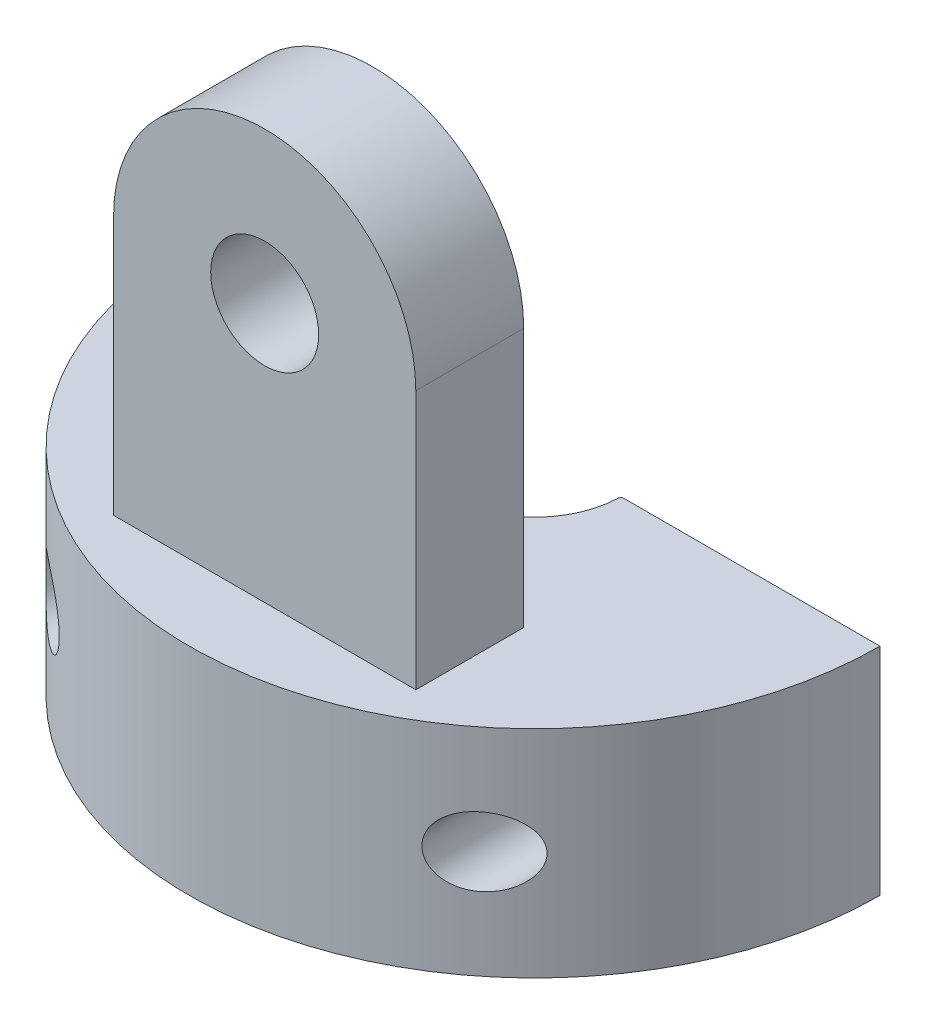
ISO-10303-21;
HEADER;
FILE_DESCRIPTION(('STEP AP214'),'2;1');
FILE_NAME('part.step','',(''),(''),'','','');
FILE_SCHEMA(('AUTOMOTIVE_DESIGN { 1 0 10303 214 1 1 1 1 }'));
ENDSEC;
DATA;
#1=APPLICATION_CONTEXT('core data for automotive mechanical design processes');
#2=APPLICATION_PROTOCOL_DEFINITION('international standard','automotive_design',2000,#1);
#3=PRODUCT_CONTEXT('',#1,'mechanical');
#4=PRODUCT('Part','Part','',(#3));
#5=PRODUCT_RELATED_PRODUCT_CATEGORY('part','',(#4));
#6=PRODUCT_DEFINITION_FORMATION('','',#4);
#7=PRODUCT_DEFINITION_CONTEXT('part definition',#1,'design');
#8=PRODUCT_DEFINITION('design','',#6,#7);
#9=PRODUCT_DEFINITION_SHAPE('','',#8);
#10=(LENGTH_UNIT() NAMED_UNIT(*) SI_UNIT(.MILLI.,.METRE.));
#11=(NAMED_UNIT(*) PLANE_ANGLE_UNIT() SI_UNIT($,.RADIAN.));
#12=(NAMED_UNIT(*) SI_UNIT($,.STERADIAN.) SOLID_ANGLE_UNIT());
#13=UNCERTAINTY_MEASURE_WITH_UNIT(LENGTH_MEASURE(1.E-05),#10,'distance_accuracy_value','');
#14=(GEOMETRIC_REPRESENTATION_CONTEXT(3) GLOBAL_UNCERTAINTY_ASSIGNED_CONTEXT((#13)) GLOBAL_UNIT_ASSIGNED_CONTEXT((#10,
#11,#12)) REPRESENTATION_CONTEXT('',''));
#15=CARTESIAN_POINT('',(0.,0.,0.));
#16=DIRECTION('',(0.,0.,1.));
#17=DIRECTION('',(1.,0.,0.));
#18=AXIS2_PLACEMENT_3D('',#15,#16,#17);
#19=CARTESIAN_POINT('',(3.5,12.,6.25));
#20=DIRECTION('',(0.,0.,1.));
#21=DIRECTION('',(1.,0.,0.));
#22=AXIS2_PLACEMENT_3D('',#19,#20,#21);
#23=PLANE('',#22);
#24=CARTESIAN_POINT('',(0.,8.5,6.25));
#25=DIRECTION('',(0.,0.,1.));
#26=DIRECTION('',(1.,0.,0.));
#27=AXIS2_PLACEMENT_3D('',#24,#25,#26);
#28=CIRCLE('',#27,1.25);
#29=CARTESIAN_POINT('',(1.25,8.5,6.25));
#30=VERTEX_POINT('',#29);
#31=EDGE_CURVE('E131',#30,#30,#28,.T.);
#32=ORIENTED_EDGE('',*,*,#31,.F.);
#33=EDGE_LOOP('',(#32));
#34=FACE_BOUND('',#33,.T.);
#35=DIRECTION('',(0.,-1.,0.));
#36=VECTOR('',#35,1.);
#37=CARTESIAN_POINT('',(3.5,12.,6.25));
#38=LINE('',#37,#36);
#39=CARTESIAN_POINT('',(3.5,8.5,6.25));
#40=VERTEX_POINT('',#39);
#41=CARTESIAN_POINT('',(3.5,2.5,6.25));
#42=VERTEX_POINT('',#41);
#43=EDGE_CURVE('E137',#40,#42,#38,.T.);
#44=ORIENTED_EDGE('',*,*,#43,.F.);
#45=CARTESIAN_POINT('',(0.,8.5,6.25));
#46=DIRECTION('',(0.,0.,1.));
#47=DIRECTION('',(1.,0.,0.));
#48=AXIS2_PLACEMENT_3D('',#45,#46,#47);
#49=CIRCLE('',#48,3.5);
#50=CARTESIAN_POINT('',(-3.5,8.5,6.25));
#51=VERTEX_POINT('',#50);
#52=EDGE_CURVE('E118',#40,#51,#49,.T.);
#53=ORIENTED_EDGE('',*,*,#52,.T.);
#54=DIRECTION('',(0.,-1.,0.));
#55=VECTOR('',#54,1.);
#56=CARTESIAN_POINT('',(-3.5,12.,6.25));
#57=LINE('',#56,#55);
#58=CARTESIAN_POINT('',(-3.5,2.5,6.25));
#59=VERTEX_POINT('',#58);
#60=EDGE_CURVE('E141',#51,#59,#57,.T.);
#61=ORIENTED_EDGE('',*,*,#60,.T.);
#62=DIRECTION('',(-1.,0.,0.));
#63=VECTOR('',#62,1.);
#64=CARTESIAN_POINT('',(3.5,2.5,6.25));
#65=LINE('',#64,#63);
#66=EDGE_CURVE('E284',#42,#59,#65,.T.);
#67=ORIENTED_EDGE('',*,*,#66,.F.);
#68=EDGE_LOOP('',(#44,#53,#61,#67));
#69=FACE_BOUND('',#68,.T.);
#70=ADVANCED_FACE('F35',(#34,#69),#23,.T.);
#71=CARTESIAN_POINT('',(3.5,12.,6.25));
#72=DIRECTION('',(-1.,0.,0.));
#73=DIRECTION('',(0.,0.,1.));
#74=AXIS2_PLACEMENT_3D('',#71,#72,#73);
#75=PLANE('',#74);
#76=DIRECTION('',(0.,0.,-1.));
#77=VECTOR('',#76,1.);
#78=CARTESIAN_POINT('',(3.5,8.5,13.25));
#79=LINE('',#78,#77);
#80=CARTESIAN_POINT('',(3.5,8.5,3.75));
#81=VERTEX_POINT('',#80);
#82=EDGE_CURVE('E112',#40,#81,#79,.T.);
#83=ORIENTED_EDGE('',*,*,#82,.F.);
#84=ORIENTED_EDGE('',*,*,#43,.T.);
#85=DIRECTION('',(0.,0.,-1.));
#86=VECTOR('',#85,1.);
#87=CARTESIAN_POINT('',(3.5,2.5,6.25));
#88=LINE('',#87,#86);
#89=CARTESIAN_POINT('',(3.5,2.5,3.75));
#90=VERTEX_POINT('',#89);
#91=EDGE_CURVE('E136',#42,#90,#88,.T.);
#92=ORIENTED_EDGE('',*,*,#91,.T.);
#93=DIRECTION('',(0.,-1.,0.));
#94=VECTOR('',#93,1.);
#95=CARTESIAN_POINT('',(3.5,12.,3.75));
#96=LINE('',#95,#94);
#97=EDGE_CURVE('E128',#81,#90,#96,.T.);
#98=ORIENTED_EDGE('',*,*,#97,.F.);
#99=EDGE_LOOP('',(#83,#84,#92,#98));
#100=FACE_BOUND('',#99,.T.);
#101=ADVANCED_FACE('F134',(#100),#75,.F.);
#102=CARTESIAN_POINT('',(3.5,12.,3.75));
#103=DIRECTION('',(0.,0.,1.));
#104=DIRECTION('',(1.,0.,0.));
#105=AXIS2_PLACEMENT_3D('',#102,#103,#104);
#106=PLANE('',#105);
#107=CARTESIAN_POINT('',(0.,8.5,3.75));
#108=DIRECTION('',(0.,0.,-1.));
#109=DIRECTION('',(-1.,0.,0.));
#110=AXIS2_PLACEMENT_3D('',#107,#108,#109);
#111=CIRCLE('',#110,1.25);
#112=CARTESIAN_POINT('',(-1.25,8.5,3.75));
#113=VERTEX_POINT('',#112);
#114=EDGE_CURVE('E177',#113,#113,#111,.T.);
#115=ORIENTED_EDGE('',*,*,#114,.F.);
#116=EDGE_LOOP('',(#115));
#117=FACE_BOUND('',#116,.T.);
#118=CARTESIAN_POINT('',(0.,8.5,3.75));
#119=DIRECTION('',(0.,0.,-1.));
#120=DIRECTION('',(-1.,0.,0.));
#121=AXIS2_PLACEMENT_3D('',#118,#119,#120);
#122=CIRCLE('',#121,3.5);
#123=CARTESIAN_POINT('',(-3.5,8.5,3.75));
#124=VERTEX_POINT('',#123);
#125=EDGE_CURVE('E116',#124,#81,#122,.T.);
#126=ORIENTED_EDGE('',*,*,#125,.T.);
#127=ORIENTED_EDGE('',*,*,#97,.T.);
#128=DIRECTION('',(-1.,0.,0.));
#129=VECTOR('',#128,1.);
#130=CARTESIAN_POINT('',(3.5,2.5,3.75));
#131=LINE('',#130,#129);
#132=CARTESIAN_POINT('',(-3.5,2.5,3.75));
#133=VERTEX_POINT('',#132);
#134=EDGE_CURVE('E290',#90,#133,#131,.T.);
#135=ORIENTED_EDGE('',*,*,#134,.T.);
#136=DIRECTION('',(0.,-1.,0.));
#137=VECTOR('',#136,1.);
#138=CARTESIAN_POINT('',(-3.5,12.,3.75));
#139=LINE('',#138,#137);
#140=EDGE_CURVE('E130',#124,#133,#139,.T.);
#141=ORIENTED_EDGE('',*,*,#140,.F.);
#142=EDGE_LOOP('',(#126,#127,#135,#141));
#143=FACE_BOUND('',#142,.T.);
#144=ADVANCED_FACE('F126',(#117,#143),#106,.F.);
#145=CARTESIAN_POINT('',(0.,2.5,0.));
#146=DIRECTION('',(0.,-1.,0.));
#147=DIRECTION('',(0.,0.,-1.));
#148=AXIS2_PLACEMENT_3D('',#145,#146,#147);
#149=CYLINDRICAL_SURFACE('',#148,2.);
#150=CARTESIAN_POINT('',(0.,-2.5,0.));
#151=DIRECTION('',(0.,-1.,0.));
#152=DIRECTION('',(0.,0.,-1.));
#153=AXIS2_PLACEMENT_3D('',#150,#151,#152);
#154=CIRCLE('',#153,2.);
#155=CARTESIAN_POINT('',(1.99885612227799,-2.5,0.067632850241546));
#156=VERTEX_POINT('',#155);
#157=CARTESIAN_POINT('',(-1.99885612227799,-2.5,0.067632850241546));
#158=VERTEX_POINT('',#157);
#159=EDGE_CURVE('E139',#156,#158,#154,.T.);
#160=ORIENTED_EDGE('',*,*,#159,.T.);
#161=DIRECTION('',(0.,-1.,0.));
#162=VECTOR('',#161,1.);
#163=CARTESIAN_POINT('',(-1.99885612227799,2.5,0.067632850241546));
#164=LINE('',#163,#162);
#165=CARTESIAN_POINT('',(-1.99885612227799,2.5,0.067632850241546));
#166=VERTEX_POINT('',#165);
#167=EDGE_CURVE('E56',#158,#166,#164,.F.);
#168=ORIENTED_EDGE('',*,*,#167,.T.);
#169=CARTESIAN_POINT('',(0.,2.5,0.));
#170=DIRECTION('',(0.,-1.,0.));
#171=DIRECTION('',(0.,0.,-1.));
#172=AXIS2_PLACEMENT_3D('',#169,#170,#171);
#173=CIRCLE('',#172,2.);
#174=CARTESIAN_POINT('',(1.99885612227799,2.5,0.067632850241546));
#175=VERTEX_POINT('',#174);
#176=EDGE_CURVE('E146',#175,#166,#173,.T.);
#177=ORIENTED_EDGE('',*,*,#176,.F.);
#178=DIRECTION('',(0.,-1.,0.));
#179=VECTOR('',#178,1.);
#180=CARTESIAN_POINT('',(1.99885612227799,2.5,0.067632850241546));
#181=LINE('',#180,#179);
#182=EDGE_CURVE('E241',#175,#156,#181,.T.);
#183=ORIENTED_EDGE('',*,*,#182,.T.);
#184=EDGE_LOOP('',(#160,#168,#177,#183));
#185=FACE_BOUND('',#184,.T.);
#186=ADVANCED_FACE('F206',(#185),#149,.F.);
#187=CARTESIAN_POINT('',(-2.,2.5,0.));
#188=DIRECTION('',(0.,0.,1.));
#189=DIRECTION('',(1.,0.,0.));
#190=AXIS2_PLACEMENT_3D('',#187,#188,#189);
#191=PLANE('',#190);
#192=CARTESIAN_POINT('',(-5.,0.,0.));
#193=DIRECTION('',(0.,0.,-1.));
#194=DIRECTION('',(-1.,0.,0.));
#195=AXIS2_PLACEMENT_3D('',#192,#193,#194);
#196=CIRCLE('',#195,0.799999999999999);
#197=CARTESIAN_POINT('',(-5.8,0.,0.));
#198=VERTEX_POINT('',#197);
#199=EDGE_CURVE('E178',#198,#198,#196,.T.);
#200=ORIENTED_EDGE('',*,*,#199,.F.);
#201=EDGE_LOOP('',(#200));
#202=FACE_BOUND('',#201,.T.);
#203=DIRECTION('',(-1.,0.,0.));
#204=VECTOR('',#203,1.);
#205=CARTESIAN_POINT('',(-2.,2.5,0.));
#206=LINE('',#205,#204);
#207=CARTESIAN_POINT('',(-2.06881608655772,2.5,0.));
#208=VERTEX_POINT('',#207);
#209=CARTESIAN_POINT('',(-8.,2.5,0.));
#210=VERTEX_POINT('',#209);
#211=EDGE_CURVE('E148',#208,#210,#206,.T.);
#212=ORIENTED_EDGE('',*,*,#211,.F.);
#213=DIRECTION('',(0.,-1.,0.));
#214=VECTOR('',#213,1.);
#215=CARTESIAN_POINT('',(-2.06881608655772,2.5,0.));
#216=LINE('',#215,#214);
#217=CARTESIAN_POINT('',(-2.06881608655772,-2.5,0.));
#218=VERTEX_POINT('',#217);
#219=EDGE_CURVE('E169',#208,#218,#216,.T.);
#220=ORIENTED_EDGE('',*,*,#219,.T.);
#221=DIRECTION('',(-1.,0.,0.));
#222=VECTOR('',#221,1.);
#223=CARTESIAN_POINT('',(-2.,-2.5,0.));
#224=LINE('',#223,#222);
#225=CARTESIAN_POINT('',(-8.,-2.5,0.));
#226=VERTEX_POINT('',#225);
#227=EDGE_CURVE('E158',#218,#226,#224,.T.);
#228=ORIENTED_EDGE('',*,*,#227,.T.);
#229=DIRECTION('',(0.,-1.,0.));
#230=VECTOR('',#229,1.);
#231=CARTESIAN_POINT('',(-8.,2.5,0.));
#232=LINE('',#231,#230);
#233=EDGE_CURVE('E166',#210,#226,#232,.T.);
#234=ORIENTED_EDGE('',*,*,#233,.F.);
#235=EDGE_LOOP('',(#212,#220,#228,#234));
#236=FACE_BOUND('',#235,.T.);
#237=ADVANCED_FACE('F228',(#202,#236),#191,.F.);
#238=CARTESIAN_POINT('',(0.,2.5,0.));
#239=DIRECTION('',(0.,-1.,0.));
#240=DIRECTION('',(0.,0.,-1.));
#241=AXIS2_PLACEMENT_3D('',#238,#239,#240);
#242=CYLINDRICAL_SURFACE('',#241,8.);
#243=CARTESIAN_POINT('',(4.2,0.,6.80881781221968));
#244=CARTESIAN_POINT('',(4.19999815658813,0.0398519375539786,6.80881874752186));
#245=CARTESIAN_POINT('',(4.20299070168571,0.0796936510163014,6.8069756681062));
#246=CARTESIAN_POINT('',(4.21478727328823,0.158158117485728,6.7996776298651));
#247=CARTESIAN_POINT('',(4.22359042597688,0.196781052861335,6.79422321412269));
#248=CARTESIAN_POINT('',(4.24651019872021,0.271628923056093,6.77992115743238));
#249=CARTESIAN_POINT('',(4.26061355340452,0.307859581301269,6.77108198682769));
#250=CARTESIAN_POINT('',(4.29345544547942,0.3771831476823,6.75030490819633));
#251=CARTESIAN_POINT('',(4.31219496341803,0.410275389992716,6.73836634462201));
#252=CARTESIAN_POINT('',(4.35450543851684,0.474210553880899,6.71110596120041));
#253=CARTESIAN_POINT('',(4.37826397170844,0.504871324546449,6.69565010494241));
#254=CARTESIAN_POINT('',(4.42907773478792,0.561696158657103,6.6621465721134));
#255=CARTESIAN_POINT('',(4.4561341027191,0.587858662253455,6.64409800044151));
#256=CARTESIAN_POINT('',(4.51656316341039,0.638793164596562,6.60319322188424));
#257=CARTESIAN_POINT('',(4.55029323854408,0.662882584040535,6.58001713954043));
#258=CARTESIAN_POINT('',(4.61980156941114,0.705056513787978,6.53140388253074));
#259=CARTESIAN_POINT('',(4.65558105668972,0.723137368049157,6.50596534311183));
#260=CARTESIAN_POINT('',(4.73471532012716,0.756156332538808,6.44866297984592));
#261=CARTESIAN_POINT('',(4.77829069655179,0.769973053391657,6.4164584851251));
#262=CARTESIAN_POINT('',(4.86585376369878,0.789952213298812,6.3503139197531));
#263=CARTESIAN_POINT('',(4.90984164405192,0.796110938674948,6.31637301534489));
#264=CARTESIAN_POINT('',(5.00544335465519,0.801665326593537,6.24098445427765));
#265=CARTESIAN_POINT('',(5.05696402421883,0.79960063425965,6.19930878626382));
#266=CARTESIAN_POINT('',(5.15824057209058,0.785860494832465,6.11530022446198));
#267=CARTESIAN_POINT('',(5.20799379872201,0.774171194742353,6.0729664696926));
#268=CARTESIAN_POINT('',(5.31091648898486,0.739359762024547,5.98325982899339));
#269=CARTESIAN_POINT('',(5.36370429897909,0.714962334998839,5.93593788085564));
#270=CARTESIAN_POINT('',(5.46417110489983,0.654206144462932,5.84358309029608));
#271=CARTESIAN_POINT('',(5.5118579576136,0.617866137754804,5.79854678531797));
#272=CARTESIAN_POINT('',(5.58423578633552,0.547921068401668,5.72868892716459));
#273=CARTESIAN_POINT('',(5.61105598994912,0.517976708158641,5.70239341170217));
#274=CARTESIAN_POINT('',(5.66083914587371,0.452735802526572,5.65297448542324));
#275=CARTESIAN_POINT('',(5.68380894754742,0.417448978229508,5.62984545557399));
#276=CARTESIAN_POINT('',(5.72013138845229,0.350043436918286,5.59290752424896));
#277=CARTESIAN_POINT('',(5.73448609387071,0.318978845122978,5.57817088409482));
#278=CARTESIAN_POINT('',(5.75943501785463,0.253908330320489,5.55240760398823));
#279=CARTESIAN_POINT('',(5.77003167378517,0.219904331596927,5.54137855963637));
#280=CARTESIAN_POINT('',(5.78679180136054,0.14928497444153,5.52387476991184));
#281=CARTESIAN_POINT('',(5.79291113445185,0.112647426546002,5.51744538248681));
#282=CARTESIAN_POINT('',(5.79994863533432,0.0383418519414037,5.51004763957584));
#283=CARTESIAN_POINT('',(5.80087216500529,0.000674927875699032,5.50907365431824));
#284=CARTESIAN_POINT('',(5.79769888747086,-0.0685037570937168,5.51241222283676));
#285=CARTESIAN_POINT('',(5.79433369049144,-0.100092002778029,5.51595440629535));
#286=CARTESIAN_POINT('',(5.78404934819513,-0.162028168005945,5.52673757576545));
#287=CARTESIAN_POINT('',(5.77712867276166,-0.192375547461649,5.53398015425168));
#288=CARTESIAN_POINT('',(5.75804851005671,-0.258499860525437,5.55383728681834));
#289=CARTESIAN_POINT('',(5.74501529008499,-0.293756003579797,5.56733879758455));
#290=CARTESIAN_POINT('',(5.71499740640622,-0.360738415603172,5.59814860781558));
#291=CARTESIAN_POINT('',(5.69800607021407,-0.392458588717965,5.61546333277194));
#292=CARTESIAN_POINT('',(5.65410649965383,-0.463085939740555,5.65971416715389));
#293=CARTESIAN_POINT('',(5.62584236015895,-0.500389864031218,5.68785521608543));
#294=CARTESIAN_POINT('',(5.56499040932441,-0.568215459687125,5.74740875017831));
#295=CARTESIAN_POINT('',(5.53239506335732,-0.598725058249408,5.7788269152972));
#296=CARTESIAN_POINT('',(5.45318497279639,-0.66175864313667,5.85376698178726));
#297=CARTESIAN_POINT('',(5.4053727770045,-0.691931406884803,5.89800256137496));
#298=CARTESIAN_POINT('',(5.3056469713107,-0.741404186505946,5.98787376217017));
#299=CARTESIAN_POINT('',(5.25373036093444,-0.760696162747686,6.03351039240693));
#300=CARTESIAN_POINT('',(5.14647198093169,-0.788445017474554,6.12526387804842));
#301=CARTESIAN_POINT('',(5.09109960104531,-0.796784213023055,6.17138066720966));
#302=CARTESIAN_POINT('',(4.97880399747824,-0.801688024707797,6.26232519771531));
#303=CARTESIAN_POINT('',(4.92188202226315,-0.79826185671176,6.30715392026407));
#304=CARTESIAN_POINT('',(4.81720292939666,-0.780347154439991,6.38734680033512));
#305=CARTESIAN_POINT('',(4.7694201485329,-0.767693908396838,6.42308651699252));
#306=CARTESIAN_POINT('',(4.67538048419636,-0.732890536898496,6.49185603190666));
#307=CARTESIAN_POINT('',(4.62912182186304,-0.710751937971945,6.52488906145815));
#308=CARTESIAN_POINT('',(4.54785540560439,-0.661369787494114,6.58171908485209));
#309=CARTESIAN_POINT('',(4.5123031664144,-0.635717534198905,6.60611707183476));
#310=CARTESIAN_POINT('',(4.44478131880778,-0.577677385096719,6.65173484790557));
#311=CARTESIAN_POINT('',(4.41281099841518,-0.545290831530873,6.6729552688799));
#312=CARTESIAN_POINT('',(4.35374537905656,-0.473834746600487,6.71164369469396));
#313=CARTESIAN_POINT('',(4.32669055111269,-0.434714483302282,6.72908075912679));
#314=CARTESIAN_POINT('',(4.27945072467692,-0.350879475964772,6.75922277977894));
#315=CARTESIAN_POINT('',(4.25925973322227,-0.306169659185623,6.77193186501779));
#316=CARTESIAN_POINT('',(4.22914142917108,-0.218333184609024,6.79077620742901));
#317=CARTESIAN_POINT('',(4.21827455362461,-0.175658131299035,6.797516449311));
#318=CARTESIAN_POINT('',(4.20370738027974,-0.0886503795811212,6.80653516508109));
#319=CARTESIAN_POINT('',(4.2000020500365,-0.0443188675187276,6.8088167720812));
#320=CARTESIAN_POINT('',(4.2,0.,6.80881781221968));
#321=B_SPLINE_CURVE_WITH_KNOTS('',3,(#243,#244,#245,#246,#247,#248,#249,#250,#251,#252,#253,
#254,#255,#256,#257,#258,#259,#260,#261,#262,#263,#264,#265,#266,#267,#268,#269,#270,#271,#272,
#273,#274,#275,#276,#277,#278,#279,#280,#281,#282,#283,#284,#285,#286,#287,#288,#289,#290,#291,
#292,#293,#294,#295,#296,#297,#298,#299,#300,#301,#302,#303,#304,#305,#306,#307,#308,#309,#310,
#311,#312,#313,#314,#315,#316,#317,#318,#319,#320),.UNSPECIFIED.,.T.,.F.,(4,2,2,2,2,2,2,2,2,2,2,
2,2,2,2,2,2,2,2,2,2,2,2,2,2,2,2,2,2,2,2,2,2,2,2,2,2,2,4),(0.,0.119386956410995,
0.238755963148914,0.357828180984911,0.476925604143475,0.601694361897775,0.726506298409561,
0.868432573671535,1.0104450496153,1.17757391630796,1.34478379911935,1.54289802657,
1.74129790548188,1.96517315359274,2.18869845435768,2.33237150944051,2.47578621250764,
2.58715295307343,2.69844733164416,2.81082461541598,2.92308590862406,3.01852364895732,
3.11400249581101,3.23316837705336,3.35253661754904,3.51547867809495,3.67870799946382,
3.89295859714682,4.10736729430324,4.32406136967572,4.54058574623285,4.72286533673009,
4.90492404791,5.05484084450981,5.20472778916783,5.35579781222864,5.50673559198264,
5.63959780827547,5.77236662779588),.UNSPECIFIED.);
#322=CARTESIAN_POINT('',(4.2,0.,6.80881781221968));
#323=VERTEX_POINT('',#322);
#324=EDGE_CURVE('E179',#323,#323,#321,.T.);
#325=ORIENTED_EDGE('',*,*,#324,.T.);
#326=EDGE_LOOP('',(#325));
#327=FACE_BOUND('',#326,.T.);
#328=CARTESIAN_POINT('',(-5.8,0.,5.50999092558236));
#329=CARTESIAN_POINT('',(-5.79999973358509,0.0355835805720054,5.50999124826604));
#330=CARTESIAN_POINT('',(-5.79760570697369,0.0711688542684127,5.5125145186994));
#331=CARTESIAN_POINT('',(-5.78825657518645,0.141059388361412,5.52233007609707));
#332=CARTESIAN_POINT('',(-5.78129776035944,0.175363583683178,5.52962624182094));
#333=CARTESIAN_POINT('',(-5.76345778785487,0.241446130887767,5.54821738352307));
#334=CARTESIAN_POINT('',(-5.75260786076298,0.273242202337872,5.55948050762745));
#335=CARTESIAN_POINT('',(-5.72763551496213,0.33411234882179,5.58520486413386));
#336=CARTESIAN_POINT('',(-5.71351139285339,0.363184995901577,5.59966776103823));
#337=CARTESIAN_POINT('',(-5.67540560747492,0.43124919694663,5.63833332650835));
#338=CARTESIAN_POINT('',(-5.64989105464832,0.468583150794455,5.66394128377098));
#339=CARTESIAN_POINT('',(-5.59457160287021,0.537057304568443,5.71859180840594));
#340=CARTESIAN_POINT('',(-5.56475655089598,0.568182419616093,5.74764247384825));
#341=CARTESIAN_POINT('',(-5.49118595937438,0.633977987668749,5.81809764546845));
#342=CARTESIAN_POINT('',(-5.44612846531558,0.666280398729729,5.86035450441284));
#343=CARTESIAN_POINT('',(-5.35177965424885,0.720565891945562,5.94664258446718));
#344=CARTESIAN_POINT('',(-5.30248626832814,0.742543897130304,5.99067466700208));
#345=CARTESIAN_POINT('',(-5.20009818086177,0.77647203497336,6.07977357327865));
#346=CARTESIAN_POINT('',(-5.14695875880767,0.788272298288977,6.12484614654851));
#347=CARTESIAN_POINT('',(-5.03869194465854,0.800920520662119,6.21421863764797));
#348=CARTESIAN_POINT('',(-4.98356348147957,0.801762487755128,6.25851811953458));
#349=CARTESIAN_POINT('',(-4.86938758415617,0.79146951180582,6.34780460741192));
#350=CARTESIAN_POINT('',(-4.8103056951263,0.779603136717774,6.39266960759626));
#351=CARTESIAN_POINT('',(-4.69396300000007,0.741662965507482,6.47857262918769));
#352=CARTESIAN_POINT('',(-4.63669815150724,0.715623447925527,6.51961960537207));
#353=CARTESIAN_POINT('',(-4.54564119505754,0.65983541586275,6.58324709631966));
#354=CARTESIAN_POINT('',(-4.51039918612075,0.634233078544581,6.6074153083986));
#355=CARTESIAN_POINT('',(-4.44347673786339,0.576396684069572,6.65260376952235));
#356=CARTESIAN_POINT('',(-4.41179437907718,0.544166227782096,6.67362571717406));
#357=CARTESIAN_POINT('',(-4.35324748055249,0.473123559868047,6.71196509357476));
#358=CARTESIAN_POINT('',(-4.32642297889707,0.434261363858143,6.72925194463207));
#359=CARTESIAN_POINT('',(-4.27954455421549,0.351024248730319,6.7591624485206));
#360=CARTESIAN_POINT('',(-4.25948488531075,0.306654052022607,6.77179005965528));
#361=CARTESIAN_POINT('',(-4.22973812824844,0.220219630065491,6.79040366263643));
#362=CARTESIAN_POINT('',(-4.21901555332227,0.178654261816224,6.79705664081389));
#363=CARTESIAN_POINT('',(-4.20436972317929,0.0939003552319894,6.80612609329367));
#364=CARTESIAN_POINT('',(-4.20044167440536,0.0507129832212249,6.80854555436807));
#365=CARTESIAN_POINT('',(-4.19966837505092,-0.0314891560182067,6.80902220456184));
#366=CARTESIAN_POINT('',(-4.20216594801705,-0.0704975310595007,6.80748414466458));
#367=CARTESIAN_POINT('',(-4.21274668225058,-0.147442897931287,6.80094138630309));
#368=CARTESIAN_POINT('',(-4.22082893718243,-0.185380062568346,6.79593725034649));
#369=CARTESIAN_POINT('',(-4.24207496112872,-0.258844721712143,6.782695142223));
#370=CARTESIAN_POINT('',(-4.2551960372975,-0.294389589163474,6.7744843298707));
#371=CARTESIAN_POINT('',(-4.28591559772556,-0.362607168053462,6.75509112688314));
#372=CARTESIAN_POINT('',(-4.30351500938852,-0.395279282695266,6.74390812072473));
#373=CARTESIAN_POINT('',(-4.34383691341752,-0.459325705342622,6.71801250884323));
#374=CARTESIAN_POINT('',(-4.36683114066248,-0.490450490644214,6.70310810315783));
#375=CARTESIAN_POINT('',(-4.41621696428757,-0.548312276697212,6.67067468208536));
#376=CARTESIAN_POINT('',(-4.44260995776471,-0.575047462720699,6.65314458689614));
#377=CARTESIAN_POINT('',(-4.50157500164994,-0.627149711006334,6.61341388755191));
#378=CARTESIAN_POINT('',(-4.53450323432731,-0.651874890232797,6.59090224869427));
#379=CARTESIAN_POINT('',(-4.60251798276003,-0.695443788911803,6.5435883498285));
#380=CARTESIAN_POINT('',(-4.63760572379955,-0.714284131844135,6.51878478532728));
#381=CARTESIAN_POINT('',(-4.71527487483957,-0.749028199820446,6.4628823516191));
#382=CARTESIAN_POINT('',(-4.75809499933907,-0.763844791121631,6.43144047512458));
#383=CARTESIAN_POINT('',(-4.84429726466845,-0.785964258801264,6.36676497784262));
#384=CARTESIAN_POINT('',(-4.88767968025762,-0.79326330995545,6.3335304539268));
#385=CARTESIAN_POINT('',(-4.98217108191166,-0.801454938606386,6.25956874391525));
#386=CARTESIAN_POINT('',(-5.03321605345837,-0.800903070299313,6.21859787713727));
#387=CARTESIAN_POINT('',(-5.13374057013211,-0.790362305047729,6.13587471551614));
#388=CARTESIAN_POINT('',(-5.18321797694845,-0.780361046521654,6.09412146731082));
#389=CARTESIAN_POINT('',(-5.28619130638612,-0.749247706590643,6.00511582618944));
#390=CARTESIAN_POINT('',(-5.33931391566532,-0.726805374427412,5.95789073542791));
#391=CARTESIAN_POINT('',(-5.44077652493994,-0.670140905247464,5.86537658525044));
#392=CARTESIAN_POINT('',(-5.48912197235412,-0.635932389554335,5.82008535492431));
#393=CARTESIAN_POINT('',(-5.56426933825932,-0.568543713060423,5.74810137094313));
#394=CARTESIAN_POINT('',(-5.59292812806937,-0.538723780085801,5.72018989326539));
#395=CARTESIAN_POINT('',(-5.64631458116874,-0.473342188039791,5.6674974646057));
#396=CARTESIAN_POINT('',(-5.67104918358619,-0.437790893401187,5.6427110039738));
#397=CARTESIAN_POINT('',(-5.71011148341159,-0.369986821652554,5.60314306834854));
#398=CARTESIAN_POINT('',(-5.72551780214544,-0.338933418243957,5.5873806423862));
#399=CARTESIAN_POINT('',(-5.7525606760845,-0.273670874558833,5.55953437688915));
#400=CARTESIAN_POINT('',(-5.76420097678789,-0.239464913448487,5.54744688317178));
#401=CARTESIAN_POINT('',(-5.78212800979315,-0.17148054598356,5.52875678703121));
#402=CARTESIAN_POINT('',(-5.78877968299074,-0.137903504549602,5.52178141154354));
#403=CARTESIAN_POINT('',(-5.79771414827513,-0.0695508936137936,5.51240005932564));
#404=CARTESIAN_POINT('',(-5.80000026037045,-0.0347762553910272,5.50999061021978));
#405=CARTESIAN_POINT('',(-5.8,0.,5.50999092558236));
#406=B_SPLINE_CURVE_WITH_KNOTS('',3,(#328,#329,#330,#331,#332,#333,#334,#335,#336,#337,#338,
#339,#340,#341,#342,#343,#344,#345,#346,#347,#348,#349,#350,#351,#352,#353,#354,#355,#356,#357,
#358,#359,#360,#361,#362,#363,#364,#365,#366,#367,#368,#369,#370,#371,#372,#373,#374,#375,#376,
#377,#378,#379,#380,#381,#382,#383,#384,#385,#386,#387,#388,#389,#390,#391,#392,#393,#394,#395,
#396,#397,#398,#399,#400,#401,#402,#403,#404,#405),.UNSPECIFIED.,.T.,.F.,(4,2,2,2,2,2,2,2,2,2,2,
2,2,2,2,2,2,2,2,2,2,2,2,2,2,2,2,2,2,2,2,2,2,2,2,2,2,2,4),(0.,0.106594223265779,0.2132751795996,
0.319118389438811,0.425016788274055,0.580056688604109,0.735468802088834,0.943503458805495,
1.15164030861527,1.36279210440237,1.57405935252996,1.7981738086664,2.02174862447207,
2.17062288767615,2.31941648436478,2.46938555093108,2.61922691482219,2.7488162251249,
2.87831407246221,2.99510498128706,3.11187694061724,3.2276805996096,3.34350825954311,
3.46741586423834,3.59137456596085,3.73162886646125,3.87196349294204,4.03680127360103,
4.20172288892017,4.39732577758954,4.59318490648068,4.81577809095763,5.03811444914369,
5.18734570714471,5.33631006581448,5.45014360911507,5.56386358858629,5.66811870504593,
5.77229450388095),.UNSPECIFIED.);
#407=CARTESIAN_POINT('',(-5.8,0.,5.50999092558236));
#408=VERTEX_POINT('',#407);
#409=EDGE_CURVE('E170',#408,#408,#406,.T.);
#410=ORIENTED_EDGE('',*,*,#409,.T.);
#411=EDGE_LOOP('',(#410));
#412=FACE_BOUND('',#411,.T.);
#413=CARTESIAN_POINT('',(0.,-2.5,0.));
#414=DIRECTION('',(0.,1.,0.));
#415=DIRECTION('',(0.,0.,1.));
#416=AXIS2_PLACEMENT_3D('',#413,#414,#415);
#417=CIRCLE('',#416,8.);
#418=CARTESIAN_POINT('',(8.,-2.5,0.));
#419=VERTEX_POINT('',#418);
#420=EDGE_CURVE('E160',#226,#419,#417,.T.);
#421=ORIENTED_EDGE('',*,*,#420,.T.);
#422=DIRECTION('',(0.,-1.,0.));
#423=VECTOR('',#422,1.);
#424=CARTESIAN_POINT('',(8.,2.5,0.));
#425=LINE('',#424,#423);
#426=CARTESIAN_POINT('',(8.,2.5,0.));
#427=VERTEX_POINT('',#426);
#428=EDGE_CURVE('E156',#427,#419,#425,.T.);
#429=ORIENTED_EDGE('',*,*,#428,.F.);
#430=CARTESIAN_POINT('',(0.,2.5,0.));
#431=DIRECTION('',(0.,1.,0.));
#432=DIRECTION('',(0.,0.,1.));
#433=AXIS2_PLACEMENT_3D('',#430,#431,#432);
#434=CIRCLE('',#433,8.);
#435=EDGE_CURVE('E151',#210,#427,#434,.T.);
#436=ORIENTED_EDGE('',*,*,#435,.F.);
#437=ORIENTED_EDGE('',*,*,#233,.T.);
#438=EDGE_LOOP('',(#421,#429,#436,#437));
#439=FACE_BOUND('',#438,.T.);
#440=ADVANCED_FACE('F184',(#327,#412,#439),#242,.T.);
#441=CARTESIAN_POINT('',(2.,2.5,0.));
#442=DIRECTION('',(0.,0.,-1.));
#443=DIRECTION('',(-1.,0.,0.));
#444=AXIS2_PLACEMENT_3D('',#441,#442,#443);
#445=PLANE('',#444);
#446=CARTESIAN_POINT('',(5.,0.,0.));
#447=DIRECTION('',(0.,0.,-1.));
#448=DIRECTION('',(-1.,0.,0.));
#449=AXIS2_PLACEMENT_3D('',#446,#447,#448);
#450=CIRCLE('',#449,0.799999999999999);
#451=CARTESIAN_POINT('',(4.2,0.,0.));
#452=VERTEX_POINT('',#451);
#453=EDGE_CURVE('E232',#452,#452,#450,.T.);
#454=ORIENTED_EDGE('',*,*,#453,.F.);
#455=EDGE_LOOP('',(#454));
#456=FACE_BOUND('',#455,.T.);
#457=DIRECTION('',(1.,0.,0.));
#458=VECTOR('',#457,1.);
#459=CARTESIAN_POINT('',(2.,-2.5,0.));
#460=LINE('',#459,#458);
#461=CARTESIAN_POINT('',(2.06881608655772,-2.5,0.));
#462=VERTEX_POINT('',#461);
#463=EDGE_CURVE('E149',#462,#419,#460,.T.);
#464=ORIENTED_EDGE('',*,*,#463,.F.);
#465=DIRECTION('',(0.,1.,0.));
#466=VECTOR('',#465,1.);
#467=CARTESIAN_POINT('',(2.06881608655772,2.5,0.));
#468=LINE('',#467,#466);
#469=CARTESIAN_POINT('',(2.06881608655772,2.5,0.));
#470=VERTEX_POINT('',#469);
#471=EDGE_CURVE('E11',#462,#470,#468,.T.);
#472=ORIENTED_EDGE('',*,*,#471,.T.);
#473=DIRECTION('',(1.,0.,0.));
#474=VECTOR('',#473,1.);
#475=CARTESIAN_POINT('',(2.,2.5,0.));
#476=LINE('',#475,#474);
#477=EDGE_CURVE('E154',#470,#427,#476,.T.);
#478=ORIENTED_EDGE('',*,*,#477,.T.);
#479=ORIENTED_EDGE('',*,*,#428,.T.);
#480=EDGE_LOOP('',(#464,#472,#478,#479));
#481=FACE_BOUND('',#480,.T.);
#482=ADVANCED_FACE('F218',(#456,#481),#445,.T.);
#483=CARTESIAN_POINT('',(0.,2.5,0.));
#484=DIRECTION('',(0.,-1.,0.));
#485=DIRECTION('',(0.,0.,-1.));
#486=AXIS2_PLACEMENT_3D('',#483,#484,#485);
#487=PLANE('',#486);
#488=ORIENTED_EDGE('',*,*,#91,.F.);
#489=ORIENTED_EDGE('',*,*,#66,.T.);
#490=DIRECTION('',(0.,0.,1.));
#491=VECTOR('',#490,1.);
#492=CARTESIAN_POINT('',(-3.5,2.5,3.75));
#493=LINE('',#492,#491);
#494=EDGE_CURVE('E287',#133,#59,#493,.T.);
#495=ORIENTED_EDGE('',*,*,#494,.F.);
#496=ORIENTED_EDGE('',*,*,#134,.F.);
#497=EDGE_LOOP('',(#488,#489,#495,#496));
#498=FACE_BOUND('',#497,.T.);
#499=ORIENTED_EDGE('',*,*,#176,.T.);
#500=CARTESIAN_POINT('',(-2.06881608655772,2.5,0.0700000000000001));
#501=DIRECTION('',(0.,-1.,0.));
#502=DIRECTION('',(0.,0.,-1.));
#503=AXIS2_PLACEMENT_3D('',#500,#501,#502);
#504=CIRCLE('',#503,0.07);
#505=EDGE_CURVE('E43',#166,#208,#504,.F.);
#506=ORIENTED_EDGE('',*,*,#505,.T.);
#507=ORIENTED_EDGE('',*,*,#211,.T.);
#508=ORIENTED_EDGE('',*,*,#435,.T.);
#509=ORIENTED_EDGE('',*,*,#477,.F.);
#510=CARTESIAN_POINT('',(2.06881608655772,2.5,0.0700000000000001));
#511=DIRECTION('',(0.,-1.,0.));
#512=DIRECTION('',(0.,0.,-1.));
#513=AXIS2_PLACEMENT_3D('',#510,#511,#512);
#514=CIRCLE('',#513,0.07);
#515=EDGE_CURVE('E240',#470,#175,#514,.F.);
#516=ORIENTED_EDGE('',*,*,#515,.T.);
#517=EDGE_LOOP('',(#499,#506,#507,#508,#509,#516));
#518=FACE_BOUND('',#517,.T.);
#519=ADVANCED_FACE('F215',(#498,#518),#487,.F.);
#520=CARTESIAN_POINT('',(0.,-2.5,0.));
#521=DIRECTION('',(0.,-1.,0.));
#522=DIRECTION('',(0.,0.,-1.));
#523=AXIS2_PLACEMENT_3D('',#520,#521,#522);
#524=PLANE('',#523);
#525=ORIENTED_EDGE('',*,*,#227,.F.);
#526=CARTESIAN_POINT('',(-2.06881608655772,-2.5,0.0700000000000001));
#527=DIRECTION('',(0.,-1.,0.));
#528=DIRECTION('',(0.,0.,-1.));
#529=AXIS2_PLACEMENT_3D('',#526,#527,#528);
#530=CIRCLE('',#529,0.07);
#531=EDGE_CURVE('E247',#218,#158,#530,.T.);
#532=ORIENTED_EDGE('',*,*,#531,.T.);
#533=ORIENTED_EDGE('',*,*,#159,.F.);
#534=CARTESIAN_POINT('',(2.06881608655772,-2.5,0.0700000000000001));
#535=DIRECTION('',(0.,-1.,0.));
#536=DIRECTION('',(0.,0.,-1.));
#537=AXIS2_PLACEMENT_3D('',#534,#535,#536);
#538=CIRCLE('',#537,0.07);
#539=EDGE_CURVE('E238',#156,#462,#538,.T.);
#540=ORIENTED_EDGE('',*,*,#539,.T.);
#541=ORIENTED_EDGE('',*,*,#463,.T.);
#542=ORIENTED_EDGE('',*,*,#420,.F.);
#543=EDGE_LOOP('',(#525,#532,#533,#540,#541,#542));
#544=FACE_BOUND('',#543,.T.);
#545=ADVANCED_FACE('F210',(#544),#524,.T.);
#546=CARTESIAN_POINT('',(-3.5,12.,3.75));
#547=DIRECTION('',(1.,0.,0.));
#548=DIRECTION('',(0.,0.,-1.));
#549=AXIS2_PLACEMENT_3D('',#546,#547,#548);
#550=PLANE('',#549);
#551=ORIENTED_EDGE('',*,*,#60,.F.);
#552=DIRECTION('',(0.,0.,-1.));
#553=VECTOR('',#552,1.);
#554=CARTESIAN_POINT('',(-3.5,8.5,13.25));
#555=LINE('',#554,#553);
#556=EDGE_CURVE('E122',#51,#124,#555,.T.);
#557=ORIENTED_EDGE('',*,*,#556,.T.);
#558=ORIENTED_EDGE('',*,*,#140,.T.);
#559=ORIENTED_EDGE('',*,*,#494,.T.);
#560=EDGE_LOOP('',(#551,#557,#558,#559));
#561=FACE_BOUND('',#560,.T.);
#562=ADVANCED_FACE('F201',(#561),#550,.F.);
#563=CARTESIAN_POINT('',(0.,8.5,13.25));
#564=DIRECTION('',(0.,0.,-1.));
#565=DIRECTION('',(-1.,0.,0.));
#566=AXIS2_PLACEMENT_3D('',#563,#564,#565);
#567=CYLINDRICAL_SURFACE('',#566,3.5);
#568=ORIENTED_EDGE('',*,*,#82,.T.);
#569=ORIENTED_EDGE('',*,*,#125,.F.);
#570=ORIENTED_EDGE('',*,*,#556,.F.);
#571=ORIENTED_EDGE('',*,*,#52,.F.);
#572=EDGE_LOOP('',(#568,#569,#570,#571));
#573=FACE_BOUND('',#572,.T.);
#574=ADVANCED_FACE('F114',(#573),#567,.T.);
#575=CARTESIAN_POINT('',(0.,8.5,13.25));
#576=DIRECTION('',(0.,0.,-1.));
#577=DIRECTION('',(-1.,0.,0.));
#578=AXIS2_PLACEMENT_3D('',#575,#576,#577);
#579=CYLINDRICAL_SURFACE('',#578,1.25);
#580=ORIENTED_EDGE('',*,*,#31,.T.);
#581=EDGE_LOOP('',(#580));
#582=FACE_BOUND('',#581,.T.);
#583=ORIENTED_EDGE('',*,*,#114,.T.);
#584=EDGE_LOOP('',(#583));
#585=FACE_BOUND('',#584,.T.);
#586=ADVANCED_FACE('F193',(#582,#585),#579,.F.);
#587=CARTESIAN_POINT('',(-5.,0.,0.));
#588=DIRECTION('',(0.,0.,-1.));
#589=DIRECTION('',(-1.,0.,0.));
#590=AXIS2_PLACEMENT_3D('',#587,#588,#589);
#591=CYLINDRICAL_SURFACE('',#590,0.799999999999999);
#592=ORIENTED_EDGE('',*,*,#199,.T.);
#593=EDGE_LOOP('',(#592));
#594=FACE_BOUND('',#593,.T.);
#595=ORIENTED_EDGE('',*,*,#409,.F.);
#596=EDGE_LOOP('',(#595));
#597=FACE_BOUND('',#596,.T.);
#598=ADVANCED_FACE('F188',(#594,#597),#591,.F.);
#599=CARTESIAN_POINT('',(5.,0.,0.));
#600=DIRECTION('',(0.,0.,-1.));
#601=DIRECTION('',(-1.,0.,0.));
#602=AXIS2_PLACEMENT_3D('',#599,#600,#601);
#603=CYLINDRICAL_SURFACE('',#602,0.799999999999999);
#604=ORIENTED_EDGE('',*,*,#453,.T.);
#605=EDGE_LOOP('',(#604));
#606=FACE_BOUND('',#605,.T.);
#607=ORIENTED_EDGE('',*,*,#324,.F.);
#608=EDGE_LOOP('',(#607));
#609=FACE_BOUND('',#608,.T.);
#610=ADVANCED_FACE('F192',(#606,#609),#603,.F.);
#611=CARTESIAN_POINT('',(-2.06881608655772,2.5,0.0700000000000001));
#612=DIRECTION('',(0.,-1.,0.));
#613=DIRECTION('',(0.,0.,-1.));
#614=AXIS2_PLACEMENT_3D('',#611,#612,#613);
#615=CYLINDRICAL_SURFACE('',#614,0.07);
#616=ORIENTED_EDGE('',*,*,#505,.F.);
#617=ORIENTED_EDGE('',*,*,#167,.F.);
#618=ORIENTED_EDGE('',*,*,#531,.F.);
#619=ORIENTED_EDGE('',*,*,#219,.F.);
#620=EDGE_LOOP('',(#616,#617,#618,#619));
#621=FACE_BOUND('',#620,.T.);
#622=ADVANCED_FACE('F260',(#621),#615,.T.);
#623=CARTESIAN_POINT('',(2.06881608655772,2.5,0.0700000000000001));
#624=DIRECTION('',(0.,-1.,0.));
#625=DIRECTION('',(0.,0.,-1.));
#626=AXIS2_PLACEMENT_3D('',#623,#624,#625);
#627=CYLINDRICAL_SURFACE('',#626,0.07);
#628=ORIENTED_EDGE('',*,*,#515,.F.);
#629=ORIENTED_EDGE('',*,*,#471,.F.);
#630=ORIENTED_EDGE('',*,*,#539,.F.);
#631=ORIENTED_EDGE('',*,*,#182,.F.);
#632=EDGE_LOOP('',(#628,#629,#630,#631));
#633=FACE_BOUND('',#632,.T.);
#634=ADVANCED_FACE('F37',(#633),#627,.T.);
#635=CLOSED_SHELL('',(#70,#101,#144,#186,#237,#440,#482,#519,#545,#562,#574,#586,#598,#610,#622,#634));
#636=MANIFOLD_SOLID_BREP('B2',#635);
#637=ADVANCED_BREP_SHAPE_REPRESENTATION('',(#18,#636),#14);
#638=SHAPE_DEFINITION_REPRESENTATION(#9,#637);
ENDSEC;
END-ISO-10303-21;
